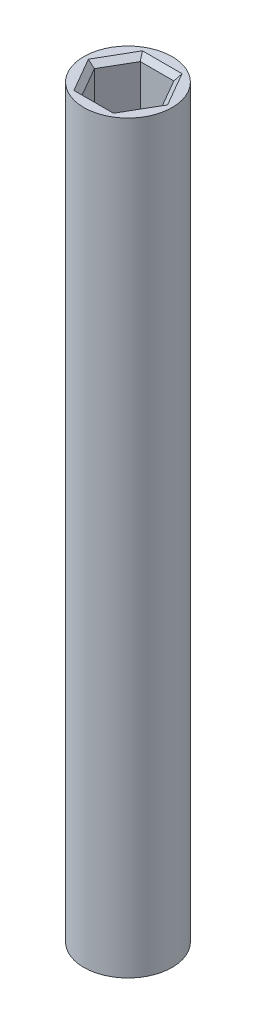
ISO-10303-21;
HEADER;
FILE_DESCRIPTION(('STEP AP214'),'2;1');
FILE_NAME('part.step','',(''),(''),'','','');
FILE_SCHEMA(('AUTOMOTIVE_DESIGN { 1 0 10303 214 1 1 1 1 }'));
ENDSEC;
DATA;
#1=APPLICATION_CONTEXT('core data for automotive mechanical design processes');
#2=APPLICATION_PROTOCOL_DEFINITION('international standard','automotive_design',2000,#1);
#3=PRODUCT_CONTEXT('',#1,'mechanical');
#4=PRODUCT('Part','Part','',(#3));
#5=PRODUCT_RELATED_PRODUCT_CATEGORY('part','',(#4));
#6=PRODUCT_DEFINITION_FORMATION('','',#4);
#7=PRODUCT_DEFINITION_CONTEXT('part definition',#1,'design');
#8=PRODUCT_DEFINITION('design','',#6,#7);
#9=PRODUCT_DEFINITION_SHAPE('','',#8);
#10=(LENGTH_UNIT() NAMED_UNIT(*) SI_UNIT(.MILLI.,.METRE.));
#11=(NAMED_UNIT(*) PLANE_ANGLE_UNIT() SI_UNIT($,.RADIAN.));
#12=(NAMED_UNIT(*) SI_UNIT($,.STERADIAN.) SOLID_ANGLE_UNIT());
#13=UNCERTAINTY_MEASURE_WITH_UNIT(LENGTH_MEASURE(1.E-05),#10,'distance_accuracy_value','');
#14=(GEOMETRIC_REPRESENTATION_CONTEXT(3) GLOBAL_UNCERTAINTY_ASSIGNED_CONTEXT((#13)) GLOBAL_UNIT_ASSIGNED_CONTEXT((#10,
#11,#12)) REPRESENTATION_CONTEXT('',''));
#15=CARTESIAN_POINT('',(0.,0.,0.));
#16=DIRECTION('',(0.,0.,1.));
#17=DIRECTION('',(1.,0.,0.));
#18=AXIS2_PLACEMENT_3D('',#15,#16,#17);
#19=CARTESIAN_POINT('',(0.,71.68750559,0.));
#20=DIRECTION('',(0.,-1.,0.));
#21=DIRECTION('',(0.,0.,-1.));
#22=AXIS2_PLACEMENT_3D('',#19,#20,#21);
#23=CYLINDRICAL_SURFACE('',#22,4.25);
#24=CARTESIAN_POINT('',(0.,71.68750559,0.));
#25=DIRECTION('',(0.,1.,0.));
#26=DIRECTION('',(0.,0.,1.));
#27=AXIS2_PLACEMENT_3D('',#24,#25,#26);
#28=CIRCLE('',#27,4.25);
#29=CARTESIAN_POINT('',(0.,71.68750559,4.25));
#30=VERTEX_POINT('',#29);
#31=EDGE_CURVE('E285',#30,#30,#28,.T.);
#32=ORIENTED_EDGE('',*,*,#31,.F.);
#33=EDGE_LOOP('',(#32));
#34=FACE_BOUND('',#33,.T.);
#35=CARTESIAN_POINT('',(0.,0.,0.));
#36=DIRECTION('',(0.,1.,0.));
#37=DIRECTION('',(0.,0.,1.));
#38=AXIS2_PLACEMENT_3D('',#35,#36,#37);
#39=CIRCLE('',#38,4.25);
#40=CARTESIAN_POINT('',(0.,0.,4.25));
#41=VERTEX_POINT('',#40);
#42=EDGE_CURVE('E265',#41,#41,#39,.T.);
#43=ORIENTED_EDGE('',*,*,#42,.T.);
#44=EDGE_LOOP('',(#43));
#45=FACE_BOUND('',#44,.T.);
#46=ADVANCED_FACE('F47',(#34,#45),#23,.T.);
#47=CARTESIAN_POINT('',(0.,71.68750559,0.));
#48=DIRECTION('',(0.,1.,0.));
#49=DIRECTION('',(0.,0.,1.));
#50=AXIS2_PLACEMENT_3D('',#47,#48,#49);
#51=PLANE('',#50);
#52=DIRECTION('',(-0.5,0.,0.866025403784439));
#53=VECTOR('',#52,1.);
#54=CARTESIAN_POINT('',(2.04959345562317,71.68750559,3.05));
#55=LINE('',#54,#53);
#56=CARTESIAN_POINT('',(3.81051177665152,71.68750559,0.));
#57=VERTEX_POINT('',#56);
#58=CARTESIAN_POINT('',(1.90525588832576,71.68750559,3.29999999999999));
#59=VERTEX_POINT('',#58);
#60=EDGE_CURVE('E308',#57,#59,#55,.T.);
#61=ORIENTED_EDGE('',*,*,#60,.T.);
#62=DIRECTION('',(-1.,0.,0.));
#63=VECTOR('',#62,1.);
#64=CARTESIAN_POINT('',(-1.61658075373095,71.68750559,3.29999999999999));
#65=LINE('',#64,#63);
#66=CARTESIAN_POINT('',(-1.90525588832576,71.68750559,3.29999999999999));
#67=VERTEX_POINT('',#66);
#68=EDGE_CURVE('E311',#59,#67,#65,.T.);
#69=ORIENTED_EDGE('',*,*,#68,.T.);
#70=DIRECTION('',(-0.5,0.,-0.866025403784439));
#71=VECTOR('',#70,1.);
#72=CARTESIAN_POINT('',(-3.66617420935412,71.68750559,0.249999999999997));
#73=LINE('',#72,#71);
#74=CARTESIAN_POINT('',(-3.81051177665152,71.68750559,0.));
#75=VERTEX_POINT('',#74);
#76=EDGE_CURVE('E299',#67,#75,#73,.T.);
#77=ORIENTED_EDGE('',*,*,#76,.T.);
#78=DIRECTION('',(0.5,0.,-0.866025403784439));
#79=VECTOR('',#78,1.);
#80=CARTESIAN_POINT('',(-2.04959345562317,71.68750559,-3.05));
#81=LINE('',#80,#79);
#82=CARTESIAN_POINT('',(-1.90525588832576,71.68750559,-3.29999999999999));
#83=VERTEX_POINT('',#82);
#84=EDGE_CURVE('E296',#75,#83,#81,.T.);
#85=ORIENTED_EDGE('',*,*,#84,.T.);
#86=DIRECTION('',(1.,0.,0.));
#87=VECTOR('',#86,1.);
#88=CARTESIAN_POINT('',(1.61658075373095,71.68750559,-3.29999999999999));
#89=LINE('',#88,#87);
#90=CARTESIAN_POINT('',(1.90525588832576,71.68750559,-3.29999999999999));
#91=VERTEX_POINT('',#90);
#92=EDGE_CURVE('E302',#83,#91,#89,.T.);
#93=ORIENTED_EDGE('',*,*,#92,.T.);
#94=DIRECTION('',(0.5,0.,0.866025403784439));
#95=VECTOR('',#94,1.);
#96=CARTESIAN_POINT('',(3.66617420935412,71.68750559,-0.249999999999998));
#97=LINE('',#96,#95);
#98=EDGE_CURVE('E305',#91,#57,#97,.T.);
#99=ORIENTED_EDGE('',*,*,#98,.T.);
#100=EDGE_LOOP('',(#61,#69,#77,#85,#93,#99));
#101=FACE_BOUND('',#100,.T.);
#102=ORIENTED_EDGE('',*,*,#31,.T.);
#103=EDGE_LOOP('',(#102));
#104=FACE_BOUND('',#103,.T.);
#105=ADVANCED_FACE('F431',(#101,#104),#51,.T.);
#106=CARTESIAN_POINT('',(0.,0.,0.));
#107=DIRECTION('',(0.,1.,0.));
#108=DIRECTION('',(0.,0.,1.));
#109=AXIS2_PLACEMENT_3D('',#106,#107,#108);
#110=PLANE('',#109);
#111=DIRECTION('',(0.866025403784439,0.,0.5));
#112=VECTOR('',#111,1.);
#113=CARTESIAN_POINT('',(-1.65,0.,2.85788383248865));
#114=LINE('',#113,#112);
#115=CARTESIAN_POINT('',(-3.3,0.,1.90525588832577));
#116=VERTEX_POINT('',#115);
#117=CARTESIAN_POINT('',(0.,0.,3.81051177665153));
#118=VERTEX_POINT('',#117);
#119=EDGE_CURVE('E364',#116,#118,#114,.T.);
#120=ORIENTED_EDGE('',*,*,#119,.T.);
#121=DIRECTION('',(0.866025403784439,0.,-0.5));
#122=VECTOR('',#121,1.);
#123=CARTESIAN_POINT('',(1.65,0.,2.85788383248865));
#124=LINE('',#123,#122);
#125=CARTESIAN_POINT('',(3.3,0.,1.90525588832577));
#126=VERTEX_POINT('',#125);
#127=EDGE_CURVE('E367',#118,#126,#124,.T.);
#128=ORIENTED_EDGE('',*,*,#127,.T.);
#129=DIRECTION('',(0.,0.,-1.));
#130=VECTOR('',#129,1.);
#131=CARTESIAN_POINT('',(3.3,0.,0.));
#132=LINE('',#131,#130);
#133=CARTESIAN_POINT('',(3.3,0.,-1.90525588832576));
#134=VERTEX_POINT('',#133);
#135=EDGE_CURVE('E352',#126,#134,#132,.T.);
#136=ORIENTED_EDGE('',*,*,#135,.T.);
#137=DIRECTION('',(-0.866025403784439,0.,-0.5));
#138=VECTOR('',#137,1.);
#139=CARTESIAN_POINT('',(1.65,0.,-2.85788383248865));
#140=LINE('',#139,#138);
#141=CARTESIAN_POINT('',(0.,0.,-3.81051177665153));
#142=VERTEX_POINT('',#141);
#143=EDGE_CURVE('E355',#134,#142,#140,.T.);
#144=ORIENTED_EDGE('',*,*,#143,.T.);
#145=DIRECTION('',(-0.866025403784439,0.,0.5));
#146=VECTOR('',#145,1.);
#147=CARTESIAN_POINT('',(-1.65,0.,-2.85788383248865));
#148=LINE('',#147,#146);
#149=CARTESIAN_POINT('',(-3.3,0.,-1.90525588832577));
#150=VERTEX_POINT('',#149);
#151=EDGE_CURVE('E358',#142,#150,#148,.T.);
#152=ORIENTED_EDGE('',*,*,#151,.T.);
#153=DIRECTION('',(0.,0.,1.));
#154=VECTOR('',#153,1.);
#155=CARTESIAN_POINT('',(-3.3,0.,0.));
#156=LINE('',#155,#154);
#157=EDGE_CURVE('E361',#150,#116,#156,.T.);
#158=ORIENTED_EDGE('',*,*,#157,.T.);
#159=EDGE_LOOP('',(#120,#128,#136,#144,#152,#158));
#160=FACE_BOUND('',#159,.T.);
#161=ORIENTED_EDGE('',*,*,#42,.F.);
#162=EDGE_LOOP('',(#161));
#163=FACE_BOUND('',#162,.T.);
#164=ADVANCED_FACE('F438',(#160,#163),#110,.F.);
#165=CARTESIAN_POINT('',(3.2331615074619,65.08750559,0.));
#166=DIRECTION('',(0.866025403784438,0.,-0.5));
#167=DIRECTION('',(-0.5,0.,-0.866025403784439));
#168=AXIS2_PLACEMENT_3D('',#165,#166,#167);
#169=PLANE('',#168);
#170=DIRECTION('',(0.,1.,0.));
#171=VECTOR('',#170,1.);
#172=CARTESIAN_POINT('',(3.2331615074619,65.08750559,0.));
#173=LINE('',#172,#171);
#174=CARTESIAN_POINT('',(3.2331615074619,65.08750559,0.));
#175=VERTEX_POINT('',#174);
#176=CARTESIAN_POINT('',(3.2331615074619,71.18750559,0.));
#177=VERTEX_POINT('',#176);
#178=EDGE_CURVE('E261',#175,#177,#173,.T.);
#179=ORIENTED_EDGE('',*,*,#178,.T.);
#180=DIRECTION('',(-0.5,0.,-0.866025403784439));
#181=VECTOR('',#180,1.);
#182=CARTESIAN_POINT('',(1.61658075373095,71.18750559,-2.8));
#183=LINE('',#182,#181);
#184=CARTESIAN_POINT('',(1.61658075373095,71.18750559,-2.8));
#185=VERTEX_POINT('',#184);
#186=EDGE_CURVE('E318',#177,#185,#183,.T.);
#187=ORIENTED_EDGE('',*,*,#186,.T.);
#188=DIRECTION('',(0.,1.,0.));
#189=VECTOR('',#188,1.);
#190=CARTESIAN_POINT('',(1.61658075373095,65.08750559,-2.8));
#191=LINE('',#190,#189);
#192=CARTESIAN_POINT('',(1.61658075373095,65.08750559,-2.8));
#193=VERTEX_POINT('',#192);
#194=EDGE_CURVE('E260',#193,#185,#191,.T.);
#195=ORIENTED_EDGE('',*,*,#194,.F.);
#196=DIRECTION('',(-0.5,0.,-0.866025403784438));
#197=VECTOR('',#196,1.);
#198=CARTESIAN_POINT('',(3.2331615074619,65.08750559,0.));
#199=LINE('',#198,#197);
#200=EDGE_CURVE('E235',#175,#193,#199,.T.);
#201=ORIENTED_EDGE('',*,*,#200,.F.);
#202=EDGE_LOOP('',(#179,#187,#195,#201));
#203=FACE_BOUND('',#202,.T.);
#204=ADVANCED_FACE('F679',(#203),#169,.F.);
#205=CARTESIAN_POINT('',(1.61658075373095,65.08750559,2.8));
#206=DIRECTION('',(0.866025403784439,0.,0.5));
#207=DIRECTION('',(0.5,0.,-0.866025403784439));
#208=AXIS2_PLACEMENT_3D('',#205,#206,#207);
#209=PLANE('',#208);
#210=DIRECTION('',(0.,1.,0.));
#211=VECTOR('',#210,1.);
#212=CARTESIAN_POINT('',(1.61658075373095,65.08750559,2.8));
#213=LINE('',#212,#211);
#214=CARTESIAN_POINT('',(1.61658075373095,65.08750559,2.8));
#215=VERTEX_POINT('',#214);
#216=CARTESIAN_POINT('',(1.61658075373095,71.18750559,2.8));
#217=VERTEX_POINT('',#216);
#218=EDGE_CURVE('E266',#215,#217,#213,.T.);
#219=ORIENTED_EDGE('',*,*,#218,.T.);
#220=DIRECTION('',(0.5,0.,-0.866025403784439));
#221=VECTOR('',#220,1.);
#222=CARTESIAN_POINT('',(3.2331615074619,71.18750559,0.));
#223=LINE('',#222,#221);
#224=EDGE_CURVE('E315',#217,#177,#223,.T.);
#225=ORIENTED_EDGE('',*,*,#224,.T.);
#226=ORIENTED_EDGE('',*,*,#178,.F.);
#227=DIRECTION('',(0.5,0.,-0.866025403784439));
#228=VECTOR('',#227,1.);
#229=CARTESIAN_POINT('',(1.61658075373095,65.08750559,2.8));
#230=LINE('',#229,#228);
#231=EDGE_CURVE('E256',#215,#175,#230,.T.);
#232=ORIENTED_EDGE('',*,*,#231,.F.);
#233=EDGE_LOOP('',(#219,#225,#226,#232));
#234=FACE_BOUND('',#233,.T.);
#235=ADVANCED_FACE('F670',(#234),#209,.F.);
#236=CARTESIAN_POINT('',(-1.61658075373095,65.08750559,2.8));
#237=DIRECTION('',(0.,0.,1.));
#238=DIRECTION('',(1.,0.,0.));
#239=AXIS2_PLACEMENT_3D('',#236,#237,#238);
#240=PLANE('',#239);
#241=DIRECTION('',(0.,1.,0.));
#242=VECTOR('',#241,1.);
#243=CARTESIAN_POINT('',(-1.61658075373095,65.08750559,2.8));
#244=LINE('',#243,#242);
#245=CARTESIAN_POINT('',(-1.61658075373095,65.08750559,2.8));
#246=VERTEX_POINT('',#245);
#247=CARTESIAN_POINT('',(-1.61658075373095,71.18750559,2.8));
#248=VERTEX_POINT('',#247);
#249=EDGE_CURVE('E270',#246,#248,#244,.T.);
#250=ORIENTED_EDGE('',*,*,#249,.T.);
#251=DIRECTION('',(1.,0.,0.));
#252=VECTOR('',#251,1.);
#253=CARTESIAN_POINT('',(1.61658075373095,71.18750559,2.8));
#254=LINE('',#253,#252);
#255=EDGE_CURVE('E289',#248,#217,#254,.T.);
#256=ORIENTED_EDGE('',*,*,#255,.T.);
#257=ORIENTED_EDGE('',*,*,#218,.F.);
#258=DIRECTION('',(1.,0.,0.));
#259=VECTOR('',#258,1.);
#260=CARTESIAN_POINT('',(-1.61658075373095,65.08750559,2.8));
#261=LINE('',#260,#259);
#262=EDGE_CURVE('E252',#246,#215,#261,.T.);
#263=ORIENTED_EDGE('',*,*,#262,.F.);
#264=EDGE_LOOP('',(#250,#256,#257,#263));
#265=FACE_BOUND('',#264,.T.);
#266=ADVANCED_FACE('F661',(#265),#240,.F.);
#267=CARTESIAN_POINT('',(-3.2331615074619,65.08750559,0.));
#268=DIRECTION('',(-0.866025403784438,0.,0.5));
#269=DIRECTION('',(0.5,0.,0.866025403784439));
#270=AXIS2_PLACEMENT_3D('',#267,#268,#269);
#271=PLANE('',#270);
#272=DIRECTION('',(0.,1.,0.));
#273=VECTOR('',#272,1.);
#274=CARTESIAN_POINT('',(-3.2331615074619,65.08750559,0.));
#275=LINE('',#274,#273);
#276=CARTESIAN_POINT('',(-3.2331615074619,65.08750559,0.));
#277=VERTEX_POINT('',#276);
#278=CARTESIAN_POINT('',(-3.2331615074619,71.18750559,0.));
#279=VERTEX_POINT('',#278);
#280=EDGE_CURVE('E274',#277,#279,#275,.T.);
#281=ORIENTED_EDGE('',*,*,#280,.T.);
#282=DIRECTION('',(0.5,0.,0.866025403784439));
#283=VECTOR('',#282,1.);
#284=CARTESIAN_POINT('',(-1.61658075373095,71.18750559,2.8));
#285=LINE('',#284,#283);
#286=EDGE_CURVE('E324',#279,#248,#285,.T.);
#287=ORIENTED_EDGE('',*,*,#286,.T.);
#288=ORIENTED_EDGE('',*,*,#249,.F.);
#289=DIRECTION('',(0.5,0.,0.866025403784438));
#290=VECTOR('',#289,1.);
#291=CARTESIAN_POINT('',(-3.2331615074619,65.08750559,0.));
#292=LINE('',#291,#290);
#293=EDGE_CURVE('E248',#277,#246,#292,.T.);
#294=ORIENTED_EDGE('',*,*,#293,.F.);
#295=EDGE_LOOP('',(#281,#287,#288,#294));
#296=FACE_BOUND('',#295,.T.);
#297=ADVANCED_FACE('F652',(#296),#271,.F.);
#298=CARTESIAN_POINT('',(-1.61658075373095,65.08750559,-2.8));
#299=DIRECTION('',(-0.866025403784439,0.,-0.5));
#300=DIRECTION('',(-0.5,0.,0.866025403784439));
#301=AXIS2_PLACEMENT_3D('',#298,#299,#300);
#302=PLANE('',#301);
#303=DIRECTION('',(0.,1.,0.));
#304=VECTOR('',#303,1.);
#305=CARTESIAN_POINT('',(-1.61658075373095,65.08750559,-2.8));
#306=LINE('',#305,#304);
#307=CARTESIAN_POINT('',(-1.61658075373095,65.08750559,-2.8));
#308=VERTEX_POINT('',#307);
#309=CARTESIAN_POINT('',(-1.61658075373095,71.18750559,-2.8));
#310=VERTEX_POINT('',#309);
#311=EDGE_CURVE('E278',#308,#310,#306,.T.);
#312=ORIENTED_EDGE('',*,*,#311,.T.);
#313=DIRECTION('',(-0.5,0.,0.866025403784439));
#314=VECTOR('',#313,1.);
#315=CARTESIAN_POINT('',(-3.2331615074619,71.18750559,0.));
#316=LINE('',#315,#314);
#317=EDGE_CURVE('E327',#310,#279,#316,.T.);
#318=ORIENTED_EDGE('',*,*,#317,.T.);
#319=ORIENTED_EDGE('',*,*,#280,.F.);
#320=DIRECTION('',(-0.5,0.,0.866025403784439));
#321=VECTOR('',#320,1.);
#322=CARTESIAN_POINT('',(-1.61658075373095,65.08750559,-2.8));
#323=LINE('',#322,#321);
#324=EDGE_CURVE('E244',#308,#277,#323,.T.);
#325=ORIENTED_EDGE('',*,*,#324,.F.);
#326=EDGE_LOOP('',(#312,#318,#319,#325));
#327=FACE_BOUND('',#326,.T.);
#328=ADVANCED_FACE('F643',(#327),#302,.F.);
#329=CARTESIAN_POINT('',(1.61658075373095,65.08750559,-2.8));
#330=DIRECTION('',(0.,0.,-1.));
#331=DIRECTION('',(-1.,0.,0.));
#332=AXIS2_PLACEMENT_3D('',#329,#330,#331);
#333=PLANE('',#332);
#334=ORIENTED_EDGE('',*,*,#194,.T.);
#335=DIRECTION('',(-1.,0.,0.));
#336=VECTOR('',#335,1.);
#337=CARTESIAN_POINT('',(-1.61658075373095,71.18750559,-2.8));
#338=LINE('',#337,#336);
#339=EDGE_CURVE('E321',#185,#310,#338,.T.);
#340=ORIENTED_EDGE('',*,*,#339,.T.);
#341=ORIENTED_EDGE('',*,*,#311,.F.);
#342=DIRECTION('',(-1.,0.,0.));
#343=VECTOR('',#342,1.);
#344=CARTESIAN_POINT('',(1.61658075373095,65.08750559,-2.8));
#345=LINE('',#344,#343);
#346=EDGE_CURVE('E239',#193,#308,#345,.T.);
#347=ORIENTED_EDGE('',*,*,#346,.F.);
#348=EDGE_LOOP('',(#334,#340,#341,#347));
#349=FACE_BOUND('',#348,.T.);
#350=ADVANCED_FACE('F634',(#349),#333,.F.);
#351=CARTESIAN_POINT('',(0.,65.08750559,0.));
#352=DIRECTION('',(0.,1.,0.));
#353=DIRECTION('',(0.,0.,1.));
#354=AXIS2_PLACEMENT_3D('',#351,#352,#353);
#355=PLANE('',#354);
#356=ORIENTED_EDGE('',*,*,#200,.T.);
#357=ORIENTED_EDGE('',*,*,#346,.T.);
#358=ORIENTED_EDGE('',*,*,#324,.T.);
#359=ORIENTED_EDGE('',*,*,#293,.T.);
#360=ORIENTED_EDGE('',*,*,#262,.T.);
#361=ORIENTED_EDGE('',*,*,#231,.T.);
#362=EDGE_LOOP('',(#356,#357,#358,#359,#360,#361));
#363=FACE_BOUND('',#362,.T.);
#364=ADVANCED_FACE('F486',(#363),#355,.T.);
#365=CARTESIAN_POINT('',(1.61658075373095,71.18750559,-2.8));
#366=DIRECTION('',(0.,0.707106781186543,0.707106781186552));
#367=DIRECTION('',(1.,0.,0.));
#368=AXIS2_PLACEMENT_3D('',#365,#366,#367);
#369=PLANE('',#368);
#370=DIRECTION('',(0.377964473009225,0.654653670707982,-0.654653670707974));
#371=VECTOR('',#370,1.);
#372=CARTESIAN_POINT('',(1.15470053837926,70.38750559,-2.00000000000001));
#373=LINE('',#372,#371);
#374=EDGE_CURVE('E343',#91,#185,#373,.F.);
#375=ORIENTED_EDGE('',*,*,#374,.F.);
#376=ORIENTED_EDGE('',*,*,#92,.F.);
#377=DIRECTION('',(-0.377964473009225,0.654653670707982,-0.654653670707974));
#378=VECTOR('',#377,1.);
#379=CARTESIAN_POINT('',(-1.15470053837926,70.38750559,-2.00000000000001));
#380=LINE('',#379,#378);
#381=EDGE_CURVE('E240',#310,#83,#380,.T.);
#382=ORIENTED_EDGE('',*,*,#381,.F.);
#383=ORIENTED_EDGE('',*,*,#339,.F.);
#384=EDGE_LOOP('',(#375,#376,#382,#383));
#385=FACE_BOUND('',#384,.T.);
#386=ADVANCED_FACE('F480',(#385),#369,.T.);
#387=CARTESIAN_POINT('',(-1.61658075373095,71.18750559,-2.8));
#388=DIRECTION('',(0.612372435695799,0.707106781186543,0.353553390593276));
#389=DIRECTION('',(0.5,0.,-0.866025403784439));
#390=AXIS2_PLACEMENT_3D('',#387,#388,#389);
#391=PLANE('',#390);
#392=ORIENTED_EDGE('',*,*,#381,.T.);
#393=ORIENTED_EDGE('',*,*,#84,.F.);
#394=DIRECTION('',(0.75592894601845,-0.654653670707982,0.));
#395=VECTOR('',#394,1.);
#396=CARTESIAN_POINT('',(-3.2331615074619,71.18750559,0.));
#397=LINE('',#396,#395);
#398=EDGE_CURVE('E339',#279,#75,#397,.F.);
#399=ORIENTED_EDGE('',*,*,#398,.F.);
#400=ORIENTED_EDGE('',*,*,#317,.F.);
#401=EDGE_LOOP('',(#392,#393,#399,#400));
#402=FACE_BOUND('',#401,.T.);
#403=ADVANCED_FACE('F473',(#402),#391,.T.);
#404=CARTESIAN_POINT('',(3.2331615074619,71.18750559,0.));
#405=DIRECTION('',(-0.612372435695798,0.707106781186543,0.353553390593276));
#406=DIRECTION('',(0.5,0.,0.866025403784439));
#407=AXIS2_PLACEMENT_3D('',#404,#405,#406);
#408=PLANE('',#407);
#409=ORIENTED_EDGE('',*,*,#374,.T.);
#410=ORIENTED_EDGE('',*,*,#186,.F.);
#411=DIRECTION('',(0.755928946018451,0.654653670707982,0.));
#412=VECTOR('',#411,1.);
#413=CARTESIAN_POINT('',(2.30940107675851,70.38750559,0.));
#414=LINE('',#413,#412);
#415=EDGE_CURVE('E335',#57,#177,#414,.F.);
#416=ORIENTED_EDGE('',*,*,#415,.F.);
#417=ORIENTED_EDGE('',*,*,#98,.F.);
#418=EDGE_LOOP('',(#409,#410,#416,#417));
#419=FACE_BOUND('',#418,.T.);
#420=ADVANCED_FACE('F466',(#419),#408,.T.);
#421=CARTESIAN_POINT('',(-3.2331615074619,71.18750559,0.));
#422=DIRECTION('',(0.612372435695799,0.707106781186543,-0.353553390593276));
#423=DIRECTION('',(-0.5,0.,-0.866025403784439));
#424=AXIS2_PLACEMENT_3D('',#421,#422,#423);
#425=PLANE('',#424);
#426=ORIENTED_EDGE('',*,*,#398,.T.);
#427=ORIENTED_EDGE('',*,*,#76,.F.);
#428=DIRECTION('',(0.377964473009224,-0.654653670707982,-0.654653670707974));
#429=VECTOR('',#428,1.);
#430=CARTESIAN_POINT('',(-1.61658075373095,71.18750559,2.8));
#431=LINE('',#430,#429);
#432=EDGE_CURVE('E332',#248,#67,#431,.F.);
#433=ORIENTED_EDGE('',*,*,#432,.F.);
#434=ORIENTED_EDGE('',*,*,#286,.F.);
#435=EDGE_LOOP('',(#426,#427,#433,#434));
#436=FACE_BOUND('',#435,.T.);
#437=ADVANCED_FACE('F459',(#436),#425,.T.);
#438=CARTESIAN_POINT('',(1.61658075373095,71.18750559,2.8));
#439=DIRECTION('',(-0.612372435695798,0.707106781186544,-0.353553390593276));
#440=DIRECTION('',(-0.5,0.,0.866025403784439));
#441=AXIS2_PLACEMENT_3D('',#438,#439,#440);
#442=PLANE('',#441);
#443=ORIENTED_EDGE('',*,*,#415,.T.);
#444=ORIENTED_EDGE('',*,*,#224,.F.);
#445=DIRECTION('',(0.377964473009227,0.654653670707982,0.654653670707973));
#446=VECTOR('',#445,1.);
#447=CARTESIAN_POINT('',(1.15470053837925,70.38750559,2.00000000000001));
#448=LINE('',#447,#446);
#449=EDGE_CURVE('E223',#59,#217,#448,.F.);
#450=ORIENTED_EDGE('',*,*,#449,.F.);
#451=ORIENTED_EDGE('',*,*,#60,.F.);
#452=EDGE_LOOP('',(#443,#444,#450,#451));
#453=FACE_BOUND('',#452,.T.);
#454=ADVANCED_FACE('F452',(#453),#442,.T.);
#455=CARTESIAN_POINT('',(-1.61658075373095,71.18750559,2.8));
#456=DIRECTION('',(0.,0.707106781186543,-0.707106781186552));
#457=DIRECTION('',(-1.,0.,0.));
#458=AXIS2_PLACEMENT_3D('',#455,#456,#457);
#459=PLANE('',#458);
#460=ORIENTED_EDGE('',*,*,#432,.T.);
#461=ORIENTED_EDGE('',*,*,#68,.F.);
#462=ORIENTED_EDGE('',*,*,#449,.T.);
#463=ORIENTED_EDGE('',*,*,#255,.F.);
#464=EDGE_LOOP('',(#460,#461,#462,#463));
#465=FACE_BOUND('',#464,.T.);
#466=ADVANCED_FACE('F446',(#465),#459,.T.);
#467=CARTESIAN_POINT('',(2.8,6.6,1.61658075373095));
#468=DIRECTION('',(0.5,0.,0.866025403784439));
#469=DIRECTION('',(0.866025403784439,0.,-0.5));
#470=AXIS2_PLACEMENT_3D('',#467,#468,#469);
#471=PLANE('',#470);
#472=DIRECTION('',(0.,-1.,0.));
#473=VECTOR('',#472,1.);
#474=CARTESIAN_POINT('',(2.8,6.6,1.61658075373095));
#475=LINE('',#474,#473);
#476=CARTESIAN_POINT('',(2.8,6.6,1.61658075373095));
#477=VERTEX_POINT('',#476);
#478=CARTESIAN_POINT('',(2.8,0.5,1.61658075373095));
#479=VERTEX_POINT('',#478);
#480=EDGE_CURVE('E220',#477,#479,#475,.T.);
#481=ORIENTED_EDGE('',*,*,#480,.T.);
#482=DIRECTION('',(-0.866025403784439,0.,0.5));
#483=VECTOR('',#482,1.);
#484=CARTESIAN_POINT('',(2.8,0.5,1.61658075373095));
#485=LINE('',#484,#483);
#486=CARTESIAN_POINT('',(0.,0.5,3.2331615074619));
#487=VERTEX_POINT('',#486);
#488=EDGE_CURVE('E184',#479,#487,#485,.T.);
#489=ORIENTED_EDGE('',*,*,#488,.T.);
#490=DIRECTION('',(0.,-1.,0.));
#491=VECTOR('',#490,1.);
#492=CARTESIAN_POINT('',(0.,6.6,3.2331615074619));
#493=LINE('',#492,#491);
#494=CARTESIAN_POINT('',(0.,6.6,3.2331615074619));
#495=VERTEX_POINT('',#494);
#496=EDGE_CURVE('E176',#495,#487,#493,.T.);
#497=ORIENTED_EDGE('',*,*,#496,.F.);
#498=DIRECTION('',(-0.866025403784439,0.,0.5));
#499=VECTOR('',#498,1.);
#500=CARTESIAN_POINT('',(2.8,6.6,1.61658075373095));
#501=LINE('',#500,#499);
#502=EDGE_CURVE('E181',#477,#495,#501,.T.);
#503=ORIENTED_EDGE('',*,*,#502,.F.);
#504=EDGE_LOOP('',(#481,#489,#497,#503));
#505=FACE_BOUND('',#504,.T.);
#506=ADVANCED_FACE('F179',(#505),#471,.F.);
#507=CARTESIAN_POINT('',(2.8,6.6,-1.61658075373095));
#508=DIRECTION('',(1.,0.,0.));
#509=DIRECTION('',(0.,0.,-1.));
#510=AXIS2_PLACEMENT_3D('',#507,#508,#509);
#511=PLANE('',#510);
#512=DIRECTION('',(0.,-1.,0.));
#513=VECTOR('',#512,1.);
#514=CARTESIAN_POINT('',(2.8,6.6,-1.61658075373095));
#515=LINE('',#514,#513);
#516=CARTESIAN_POINT('',(2.8,6.6,-1.61658075373095));
#517=VERTEX_POINT('',#516);
#518=CARTESIAN_POINT('',(2.8,0.5,-1.61658075373095));
#519=VERTEX_POINT('',#518);
#520=EDGE_CURVE('E224',#517,#519,#515,.T.);
#521=ORIENTED_EDGE('',*,*,#520,.T.);
#522=DIRECTION('',(0.,0.,1.));
#523=VECTOR('',#522,1.);
#524=CARTESIAN_POINT('',(2.8,0.5,-1.61658075373095));
#525=LINE('',#524,#523);
#526=EDGE_CURVE('E11',#519,#479,#525,.T.);
#527=ORIENTED_EDGE('',*,*,#526,.T.);
#528=ORIENTED_EDGE('',*,*,#480,.F.);
#529=DIRECTION('',(0.,0.,1.));
#530=VECTOR('',#529,1.);
#531=CARTESIAN_POINT('',(2.8,6.6,-1.61658075373095));
#532=LINE('',#531,#530);
#533=EDGE_CURVE('E188',#517,#477,#532,.T.);
#534=ORIENTED_EDGE('',*,*,#533,.F.);
#535=EDGE_LOOP('',(#521,#527,#528,#534));
#536=FACE_BOUND('',#535,.T.);
#537=ADVANCED_FACE('F415',(#536),#511,.F.);
#538=CARTESIAN_POINT('',(0.,6.6,-3.2331615074619));
#539=DIRECTION('',(0.5,0.,-0.866025403784439));
#540=DIRECTION('',(-0.866025403784439,0.,-0.5));
#541=AXIS2_PLACEMENT_3D('',#538,#539,#540);
#542=PLANE('',#541);
#543=DIRECTION('',(0.,-1.,0.));
#544=VECTOR('',#543,1.);
#545=CARTESIAN_POINT('',(0.,6.6,-3.2331615074619));
#546=LINE('',#545,#544);
#547=CARTESIAN_POINT('',(0.,6.6,-3.2331615074619));
#548=VERTEX_POINT('',#547);
#549=CARTESIAN_POINT('',(0.,0.5,-3.2331615074619));
#550=VERTEX_POINT('',#549);
#551=EDGE_CURVE('E227',#548,#550,#546,.T.);
#552=ORIENTED_EDGE('',*,*,#551,.T.);
#553=DIRECTION('',(0.866025403784439,0.,0.5));
#554=VECTOR('',#553,1.);
#555=CARTESIAN_POINT('',(0.,0.5,-3.2331615074619));
#556=LINE('',#555,#554);
#557=EDGE_CURVE('E58',#550,#519,#556,.T.);
#558=ORIENTED_EDGE('',*,*,#557,.T.);
#559=ORIENTED_EDGE('',*,*,#520,.F.);
#560=DIRECTION('',(0.866025403784439,0.,0.5));
#561=VECTOR('',#560,1.);
#562=CARTESIAN_POINT('',(0.,6.6,-3.2331615074619));
#563=LINE('',#562,#561);
#564=EDGE_CURVE('E215',#548,#517,#563,.T.);
#565=ORIENTED_EDGE('',*,*,#564,.F.);
#566=EDGE_LOOP('',(#552,#558,#559,#565));
#567=FACE_BOUND('',#566,.T.);
#568=ADVANCED_FACE('F417',(#567),#542,.F.);
#569=CARTESIAN_POINT('',(-2.8,6.6,-1.61658075373095));
#570=DIRECTION('',(-0.5,0.,-0.866025403784439));
#571=DIRECTION('',(-0.866025403784439,0.,0.5));
#572=AXIS2_PLACEMENT_3D('',#569,#570,#571);
#573=PLANE('',#572);
#574=DIRECTION('',(0.,-1.,0.));
#575=VECTOR('',#574,1.);
#576=CARTESIAN_POINT('',(-2.8,6.6,-1.61658075373095));
#577=LINE('',#576,#575);
#578=CARTESIAN_POINT('',(-2.8,6.6,-1.61658075373095));
#579=VERTEX_POINT('',#578);
#580=CARTESIAN_POINT('',(-2.8,0.5,-1.61658075373095));
#581=VERTEX_POINT('',#580);
#582=EDGE_CURVE('E230',#579,#581,#577,.T.);
#583=ORIENTED_EDGE('',*,*,#582,.T.);
#584=DIRECTION('',(0.866025403784439,0.,-0.5));
#585=VECTOR('',#584,1.);
#586=CARTESIAN_POINT('',(-2.8,0.5,-1.61658075373095));
#587=LINE('',#586,#585);
#588=EDGE_CURVE('E73',#581,#550,#587,.T.);
#589=ORIENTED_EDGE('',*,*,#588,.T.);
#590=ORIENTED_EDGE('',*,*,#551,.F.);
#591=DIRECTION('',(0.866025403784439,0.,-0.5));
#592=VECTOR('',#591,1.);
#593=CARTESIAN_POINT('',(-2.8,6.6,-1.61658075373095));
#594=LINE('',#593,#592);
#595=EDGE_CURVE('E211',#579,#548,#594,.T.);
#596=ORIENTED_EDGE('',*,*,#595,.F.);
#597=EDGE_LOOP('',(#583,#589,#590,#596));
#598=FACE_BOUND('',#597,.T.);
#599=ADVANCED_FACE('F419',(#598),#573,.F.);
#600=CARTESIAN_POINT('',(-2.8,6.6,1.61658075373095));
#601=DIRECTION('',(-1.,0.,0.));
#602=DIRECTION('',(0.,0.,1.));
#603=AXIS2_PLACEMENT_3D('',#600,#601,#602);
#604=PLANE('',#603);
#605=DIRECTION('',(0.,-1.,0.));
#606=VECTOR('',#605,1.);
#607=CARTESIAN_POINT('',(-2.8,6.6,1.61658075373095));
#608=LINE('',#607,#606);
#609=CARTESIAN_POINT('',(-2.8,6.6,1.61658075373095));
#610=VERTEX_POINT('',#609);
#611=CARTESIAN_POINT('',(-2.8,0.5,1.61658075373095));
#612=VERTEX_POINT('',#611);
#613=EDGE_CURVE('E187',#610,#612,#608,.T.);
#614=ORIENTED_EDGE('',*,*,#613,.T.);
#615=DIRECTION('',(0.,0.,-1.));
#616=VECTOR('',#615,1.);
#617=CARTESIAN_POINT('',(-2.8,0.5,1.61658075373095));
#618=LINE('',#617,#616);
#619=EDGE_CURVE('E374',#612,#581,#618,.T.);
#620=ORIENTED_EDGE('',*,*,#619,.T.);
#621=ORIENTED_EDGE('',*,*,#582,.F.);
#622=DIRECTION('',(0.,0.,-1.));
#623=VECTOR('',#622,1.);
#624=CARTESIAN_POINT('',(-2.8,6.6,1.61658075373095));
#625=LINE('',#624,#623);
#626=EDGE_CURVE('E198',#610,#579,#625,.T.);
#627=ORIENTED_EDGE('',*,*,#626,.F.);
#628=EDGE_LOOP('',(#614,#620,#621,#627));
#629=FACE_BOUND('',#628,.T.);
#630=ADVANCED_FACE('F421',(#629),#604,.F.);
#631=CARTESIAN_POINT('',(0.,6.6,3.2331615074619));
#632=DIRECTION('',(-0.5,0.,0.866025403784439));
#633=DIRECTION('',(0.866025403784439,0.,0.5));
#634=AXIS2_PLACEMENT_3D('',#631,#632,#633);
#635=PLANE('',#634);
#636=ORIENTED_EDGE('',*,*,#496,.T.);
#637=DIRECTION('',(-0.866025403784439,0.,-0.5));
#638=VECTOR('',#637,1.);
#639=CARTESIAN_POINT('',(0.,0.5,3.2331615074619));
#640=LINE('',#639,#638);
#641=EDGE_CURVE('E371',#487,#612,#640,.T.);
#642=ORIENTED_EDGE('',*,*,#641,.T.);
#643=ORIENTED_EDGE('',*,*,#613,.F.);
#644=DIRECTION('',(-0.866025403784439,0.,-0.5));
#645=VECTOR('',#644,1.);
#646=CARTESIAN_POINT('',(0.,6.6,3.2331615074619));
#647=LINE('',#646,#645);
#648=EDGE_CURVE('E191',#495,#610,#647,.T.);
#649=ORIENTED_EDGE('',*,*,#648,.F.);
#650=EDGE_LOOP('',(#636,#642,#643,#649));
#651=FACE_BOUND('',#650,.T.);
#652=ADVANCED_FACE('F192',(#651),#635,.F.);
#653=CARTESIAN_POINT('',(0.,6.6,0.));
#654=DIRECTION('',(0.,-1.,0.));
#655=DIRECTION('',(0.,0.,-1.));
#656=AXIS2_PLACEMENT_3D('',#653,#654,#655);
#657=PLANE('',#656);
#658=ORIENTED_EDGE('',*,*,#502,.T.);
#659=ORIENTED_EDGE('',*,*,#648,.T.);
#660=ORIENTED_EDGE('',*,*,#626,.T.);
#661=ORIENTED_EDGE('',*,*,#595,.T.);
#662=ORIENTED_EDGE('',*,*,#564,.T.);
#663=ORIENTED_EDGE('',*,*,#533,.T.);
#664=EDGE_LOOP('',(#658,#659,#660,#661,#662,#663));
#665=FACE_BOUND('',#664,.T.);
#666=ADVANCED_FACE('F200',(#665),#657,.T.);
#667=CARTESIAN_POINT('',(-2.8,0.5,-1.61658075373095));
#668=DIRECTION('',(-0.353553390593274,0.707106781186548,-0.612372435695794));
#669=DIRECTION('',(0.866025403784439,0.,-0.5));
#670=AXIS2_PLACEMENT_3D('',#667,#668,#669);
#671=PLANE('',#670);
#672=DIRECTION('',(-0.654653670707977,-0.654653670707977,-0.377964473009228));
#673=VECTOR('',#672,1.);
#674=CARTESIAN_POINT('',(-2.,1.3,-1.15470053837925));
#675=LINE('',#674,#673);
#676=EDGE_CURVE('E207',#150,#581,#675,.F.);
#677=ORIENTED_EDGE('',*,*,#676,.F.);
#678=ORIENTED_EDGE('',*,*,#151,.F.);
#679=DIRECTION('',(0.,-0.654653670707977,-0.755928946018454));
#680=VECTOR('',#679,1.);
#681=CARTESIAN_POINT('',(0.,1.3,-2.30940107675851));
#682=LINE('',#681,#680);
#683=EDGE_CURVE('E52',#550,#142,#682,.T.);
#684=ORIENTED_EDGE('',*,*,#683,.F.);
#685=ORIENTED_EDGE('',*,*,#588,.F.);
#686=EDGE_LOOP('',(#677,#678,#684,#685));
#687=FACE_BOUND('',#686,.T.);
#688=ADVANCED_FACE('F50',(#687),#671,.F.);
#689=CARTESIAN_POINT('',(0.,0.5,-3.2331615074619));
#690=DIRECTION('',(0.353553390593274,0.707106781186547,-0.612372435695795));
#691=DIRECTION('',(0.866025403784439,0.,0.5));
#692=AXIS2_PLACEMENT_3D('',#689,#690,#691);
#693=PLANE('',#692);
#694=ORIENTED_EDGE('',*,*,#683,.T.);
#695=ORIENTED_EDGE('',*,*,#143,.F.);
#696=DIRECTION('',(0.654653670707978,-0.654653670707977,-0.377964473009226));
#697=VECTOR('',#696,1.);
#698=CARTESIAN_POINT('',(2.,1.3,-1.15470053837925));
#699=LINE('',#698,#697);
#700=EDGE_CURVE('E391',#519,#134,#699,.T.);
#701=ORIENTED_EDGE('',*,*,#700,.F.);
#702=ORIENTED_EDGE('',*,*,#557,.F.);
#703=EDGE_LOOP('',(#694,#695,#701,#702));
#704=FACE_BOUND('',#703,.T.);
#705=ADVANCED_FACE('F408',(#704),#693,.F.);
#706=CARTESIAN_POINT('',(-2.8,0.5,1.61658075373095));
#707=DIRECTION('',(-0.707106781186547,0.707106781186547,0.));
#708=DIRECTION('',(0.,0.,-1.));
#709=AXIS2_PLACEMENT_3D('',#706,#707,#708);
#710=PLANE('',#709);
#711=ORIENTED_EDGE('',*,*,#676,.T.);
#712=ORIENTED_EDGE('',*,*,#619,.F.);
#713=DIRECTION('',(-0.654653670707977,-0.654653670707977,0.377964473009227));
#714=VECTOR('',#713,1.);
#715=CARTESIAN_POINT('',(-2.,1.3,1.15470053837925));
#716=LINE('',#715,#714);
#717=EDGE_CURVE('E387',#116,#612,#716,.F.);
#718=ORIENTED_EDGE('',*,*,#717,.F.);
#719=ORIENTED_EDGE('',*,*,#157,.F.);
#720=EDGE_LOOP('',(#711,#712,#718,#719));
#721=FACE_BOUND('',#720,.T.);
#722=ADVANCED_FACE('F400',(#721),#710,.F.);
#723=CARTESIAN_POINT('',(2.8,0.5,-1.61658075373095));
#724=DIRECTION('',(0.707106781186547,0.707106781186547,0.));
#725=DIRECTION('',(0.,0.,1.));
#726=AXIS2_PLACEMENT_3D('',#723,#724,#725);
#727=PLANE('',#726);
#728=ORIENTED_EDGE('',*,*,#700,.T.);
#729=ORIENTED_EDGE('',*,*,#135,.F.);
#730=DIRECTION('',(-0.654653670707977,0.654653670707977,-0.377964473009227));
#731=VECTOR('',#730,1.);
#732=CARTESIAN_POINT('',(2.8,0.5,1.61658075373095));
#733=LINE('',#732,#731);
#734=EDGE_CURVE('E384',#479,#126,#733,.F.);
#735=ORIENTED_EDGE('',*,*,#734,.F.);
#736=ORIENTED_EDGE('',*,*,#526,.F.);
#737=EDGE_LOOP('',(#728,#729,#735,#736));
#738=FACE_BOUND('',#737,.T.);
#739=ADVANCED_FACE('F413',(#738),#727,.F.);
#740=CARTESIAN_POINT('',(0.,0.5,3.2331615074619));
#741=DIRECTION('',(-0.353553390593274,0.707106781186547,0.612372435695795));
#742=DIRECTION('',(-0.866025403784439,0.,-0.5));
#743=AXIS2_PLACEMENT_3D('',#740,#741,#742);
#744=PLANE('',#743);
#745=ORIENTED_EDGE('',*,*,#717,.T.);
#746=ORIENTED_EDGE('',*,*,#641,.F.);
#747=DIRECTION('',(0.,-0.654653670707977,0.755928946018454));
#748=VECTOR('',#747,1.);
#749=CARTESIAN_POINT('',(0.,1.3,2.3094010767585));
#750=LINE('',#749,#748);
#751=EDGE_CURVE('E381',#118,#487,#750,.F.);
#752=ORIENTED_EDGE('',*,*,#751,.F.);
#753=ORIENTED_EDGE('',*,*,#119,.F.);
#754=EDGE_LOOP('',(#745,#746,#752,#753));
#755=FACE_BOUND('',#754,.T.);
#756=ADVANCED_FACE('F495',(#755),#744,.F.);
#757=CARTESIAN_POINT('',(2.8,0.5,1.61658075373095));
#758=DIRECTION('',(0.353553390593274,0.707106781186547,0.612372435695795));
#759=DIRECTION('',(-0.866025403784439,0.,0.5));
#760=AXIS2_PLACEMENT_3D('',#757,#758,#759);
#761=PLANE('',#760);
#762=ORIENTED_EDGE('',*,*,#734,.T.);
#763=ORIENTED_EDGE('',*,*,#127,.F.);
#764=ORIENTED_EDGE('',*,*,#751,.T.);
#765=ORIENTED_EDGE('',*,*,#488,.F.);
#766=EDGE_LOOP('',(#762,#763,#764,#765));
#767=FACE_BOUND('',#766,.T.);
#768=ADVANCED_FACE('F489',(#767),#761,.F.);
#769=CLOSED_SHELL('',(#46,#105,#164,#204,#235,#266,#297,#328,#350,#364,#386,#403,#420,#437,#454,
#466,#506,#537,#568,#599,#630,#652,#666,#688,#705,#722,#739,#756,#768));
#770=MANIFOLD_SOLID_BREP('B2',#769);
#771=ADVANCED_BREP_SHAPE_REPRESENTATION('',(#18,#770),#14);
#772=SHAPE_DEFINITION_REPRESENTATION(#9,#771);
ENDSEC;
END-ISO-10303-21;
